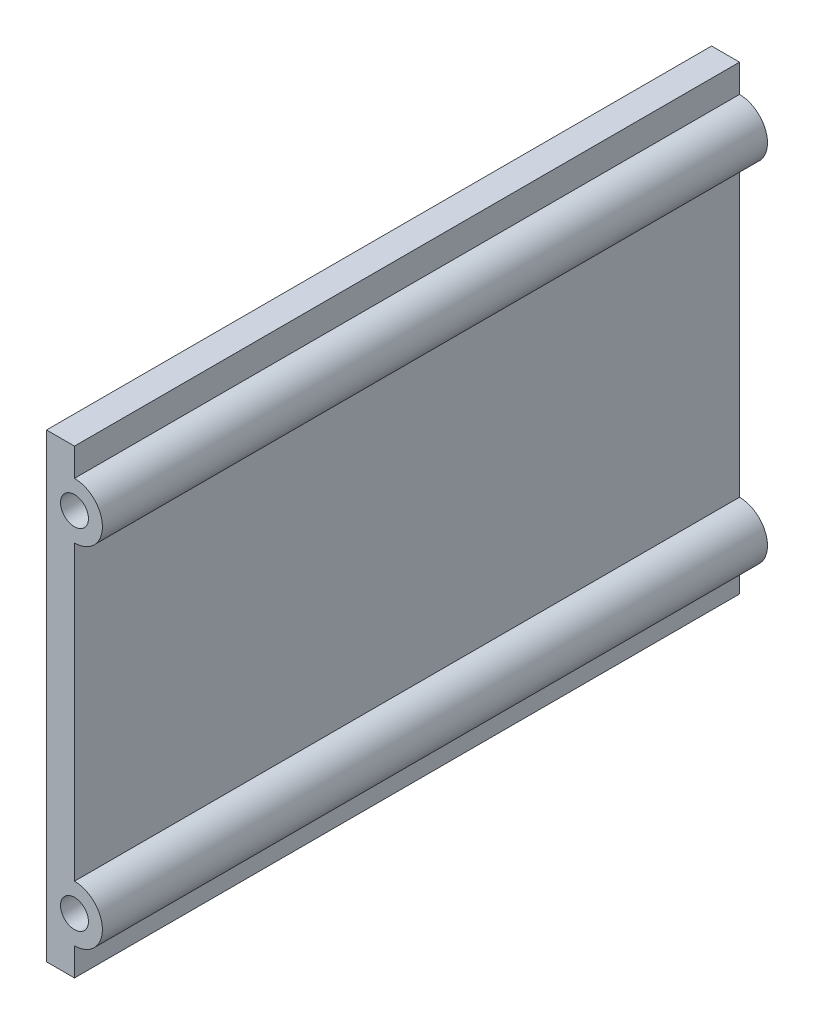
ISO-10303-21;
HEADER;
FILE_DESCRIPTION(('STEP AP214'),'2;1');
FILE_NAME('part.step','',(''),(''),'','','');
FILE_SCHEMA(('AUTOMOTIVE_DESIGN { 1 0 10303 214 1 1 1 1 }'));
ENDSEC;
DATA;
#1=APPLICATION_CONTEXT('core data for automotive mechanical design processes');
#2=APPLICATION_PROTOCOL_DEFINITION('international standard','automotive_design',2000,#1);
#3=PRODUCT_CONTEXT('',#1,'mechanical');
#4=PRODUCT('Part','Part','',(#3));
#5=PRODUCT_RELATED_PRODUCT_CATEGORY('part','',(#4));
#6=PRODUCT_DEFINITION_FORMATION('','',#4);
#7=PRODUCT_DEFINITION_CONTEXT('part definition',#1,'design');
#8=PRODUCT_DEFINITION('design','',#6,#7);
#9=PRODUCT_DEFINITION_SHAPE('','',#8);
#10=(LENGTH_UNIT() NAMED_UNIT(*) SI_UNIT(.MILLI.,.METRE.));
#11=(NAMED_UNIT(*) PLANE_ANGLE_UNIT() SI_UNIT($,.RADIAN.));
#12=(NAMED_UNIT(*) SI_UNIT($,.STERADIAN.) SOLID_ANGLE_UNIT());
#13=UNCERTAINTY_MEASURE_WITH_UNIT(LENGTH_MEASURE(1.E-05),#10,'distance_accuracy_value','');
#14=(GEOMETRIC_REPRESENTATION_CONTEXT(3) GLOBAL_UNCERTAINTY_ASSIGNED_CONTEXT((#13)) GLOBAL_UNIT_ASSIGNED_CONTEXT((#10,
#11,#12)) REPRESENTATION_CONTEXT('',''));
#15=CARTESIAN_POINT('',(0.,0.,0.));
#16=DIRECTION('',(0.,0.,1.));
#17=DIRECTION('',(1.,0.,0.));
#18=AXIS2_PLACEMENT_3D('',#15,#16,#17);
#19=CARTESIAN_POINT('',(-161.500000000327,31.210634294359,202.025691901636));
#20=DIRECTION('',(0.,0.,-1.));
#21=DIRECTION('',(-1.,0.,0.));
#22=AXIS2_PLACEMENT_3D('',#19,#20,#21);
#23=CYLINDRICAL_SURFACE('',#22,2.5);
#24=CARTESIAN_POINT('',(-161.500000000327,31.210634294359,0.));
#25=DIRECTION('',(0.,0.,1.));
#26=DIRECTION('',(1.,0.,0.));
#27=AXIS2_PLACEMENT_3D('',#24,#25,#26);
#28=CIRCLE('',#27,2.5);
#29=CARTESIAN_POINT('',(-159.000000000327,31.210634294359,0.));
#30=VERTEX_POINT('',#29);
#31=EDGE_CURVE('E140',#30,#30,#28,.T.);
#32=ORIENTED_EDGE('',*,*,#31,.F.);
#33=EDGE_LOOP('',(#32));
#34=FACE_BOUND('',#33,.T.);
#35=CARTESIAN_POINT('',(-161.500000000327,31.210634294359,118.999999999998));
#36=DIRECTION('',(0.,0.,1.));
#37=DIRECTION('',(0.,-1.,0.));
#38=AXIS2_PLACEMENT_3D('',#35,#36,#37);
#39=CIRCLE('',#38,2.5);
#40=CARTESIAN_POINT('',(-161.500000000327,28.710634294359,118.999999999998));
#41=VERTEX_POINT('',#40);
#42=EDGE_CURVE('E120',#41,#41,#39,.T.);
#43=ORIENTED_EDGE('',*,*,#42,.T.);
#44=EDGE_LOOP('',(#43));
#45=FACE_BOUND('',#44,.T.);
#46=ADVANCED_FACE('F35',(#34,#45),#23,.F.);
#47=CARTESIAN_POINT('',(-161.500000000317,26.2106342943589,202.025691901636));
#48=DIRECTION('',(-1.,0.,0.));
#49=DIRECTION('',(0.,0.,1.));
#50=AXIS2_PLACEMENT_3D('',#47,#48,#49);
#51=PLANE('',#50);
#52=DIRECTION('',(0.,1.,0.));
#53=VECTOR('',#52,1.);
#54=CARTESIAN_POINT('',(-161.500000000317,26.2106342943537,118.999999999998));
#55=LINE('',#54,#53);
#56=CARTESIAN_POINT('',(-161.500000000317,-26.2106342941675,119.));
#57=VERTEX_POINT('',#56);
#58=CARTESIAN_POINT('',(-161.500000000317,26.2106342943589,118.999999999998));
#59=VERTEX_POINT('',#58);
#60=EDGE_CURVE('E104',#57,#59,#55,.T.);
#61=ORIENTED_EDGE('',*,*,#60,.F.);
#62=DIRECTION('',(0.,0.,-1.));
#63=VECTOR('',#62,1.);
#64=CARTESIAN_POINT('',(-161.500000000317,-26.2106342941675,202.025691901636));
#65=LINE('',#64,#63);
#66=CARTESIAN_POINT('',(-161.500000000317,-26.2106342941675,0.));
#67=VERTEX_POINT('',#66);
#68=EDGE_CURVE('E51',#57,#67,#65,.T.);
#69=ORIENTED_EDGE('',*,*,#68,.T.);
#70=DIRECTION('',(0.,1.,0.));
#71=VECTOR('',#70,1.);
#72=CARTESIAN_POINT('',(-161.500000000317,26.2106342943589,0.));
#73=LINE('',#72,#71);
#74=CARTESIAN_POINT('',(-161.500000000317,26.2106342943589,0.));
#75=VERTEX_POINT('',#74);
#76=EDGE_CURVE('E107',#67,#75,#73,.T.);
#77=ORIENTED_EDGE('',*,*,#76,.T.);
#78=DIRECTION('',(0.,0.,-1.));
#79=VECTOR('',#78,1.);
#80=CARTESIAN_POINT('',(-161.500000000317,26.2106342943589,202.025691901636));
#81=LINE('',#80,#79);
#82=EDGE_CURVE('E100',#59,#75,#81,.T.);
#83=ORIENTED_EDGE('',*,*,#82,.F.);
#84=EDGE_LOOP('',(#61,#69,#77,#83));
#85=FACE_BOUND('',#84,.T.);
#86=ADVANCED_FACE('F102',(#85),#51,.F.);
#87=CARTESIAN_POINT('',(-161.500000000317,-31.2106342941764,202.025691901636));
#88=DIRECTION('',(0.,0.,-1.));
#89=DIRECTION('',(-1.,0.,0.));
#90=AXIS2_PLACEMENT_3D('',#87,#88,#89);
#91=CYLINDRICAL_SURFACE('',#90,5.00000000000894);
#92=CARTESIAN_POINT('',(-161.500000000317,-31.2106342941764,119.000000000002));
#93=DIRECTION('',(0.,0.,1.));
#94=DIRECTION('',(0.,-1.,0.));
#95=AXIS2_PLACEMENT_3D('',#92,#93,#94);
#96=CIRCLE('',#95,5.00000000000894);
#97=CARTESIAN_POINT('',(-161.500000000317,-36.2106342941854,119.000000000002));
#98=VERTEX_POINT('',#97);
#99=EDGE_CURVE('E119',#98,#57,#96,.T.);
#100=ORIENTED_EDGE('',*,*,#99,.F.);
#101=DIRECTION('',(0.,0.,-1.));
#102=VECTOR('',#101,1.);
#103=CARTESIAN_POINT('',(-161.500000000317,-36.2106342941854,202.025691901636));
#104=LINE('',#103,#102);
#105=CARTESIAN_POINT('',(-161.500000000317,-36.2106342941854,0.));
#106=VERTEX_POINT('',#105);
#107=EDGE_CURVE('E164',#98,#106,#104,.T.);
#108=ORIENTED_EDGE('',*,*,#107,.T.);
#109=CARTESIAN_POINT('',(-161.500000000317,-31.2106342941764,0.));
#110=DIRECTION('',(0.,0.,1.));
#111=DIRECTION('',(1.,0.,0.));
#112=AXIS2_PLACEMENT_3D('',#109,#110,#111);
#113=CIRCLE('',#112,5.00000000000894);
#114=EDGE_CURVE('E160',#106,#67,#113,.T.);
#115=ORIENTED_EDGE('',*,*,#114,.T.);
#116=ORIENTED_EDGE('',*,*,#68,.F.);
#117=EDGE_LOOP('',(#100,#108,#115,#116));
#118=FACE_BOUND('',#117,.T.);
#119=ADVANCED_FACE('F194',(#118),#91,.T.);
#120=CARTESIAN_POINT('',(-161.500000000317,-36.2106342941854,202.025691901636));
#121=DIRECTION('',(-1.,0.,0.));
#122=DIRECTION('',(0.,0.,1.));
#123=AXIS2_PLACEMENT_3D('',#120,#121,#122);
#124=PLANE('',#123);
#125=DIRECTION('',(0.,1.,0.));
#126=VECTOR('',#125,1.);
#127=CARTESIAN_POINT('',(-161.500000000317,-36.2106342941906,119.000000000002));
#128=LINE('',#127,#126);
#129=CARTESIAN_POINT('',(-161.500000000317,-41.2106342941854,119.000000000002));
#130=VERTEX_POINT('',#129);
#131=EDGE_CURVE('E122',#130,#98,#128,.T.);
#132=ORIENTED_EDGE('',*,*,#131,.F.);
#133=DIRECTION('',(0.,0.,-1.));
#134=VECTOR('',#133,1.);
#135=CARTESIAN_POINT('',(-161.500000000317,-41.2106342941854,202.025691901636));
#136=LINE('',#135,#134);
#137=CARTESIAN_POINT('',(-161.500000000317,-41.2106342941854,0.));
#138=VERTEX_POINT('',#137);
#139=EDGE_CURVE('E166',#130,#138,#136,.T.);
#140=ORIENTED_EDGE('',*,*,#139,.T.);
#141=DIRECTION('',(0.,1.,0.));
#142=VECTOR('',#141,1.);
#143=CARTESIAN_POINT('',(-161.500000000317,-36.2106342941854,0.));
#144=LINE('',#143,#142);
#145=EDGE_CURVE('E157',#138,#106,#144,.T.);
#146=ORIENTED_EDGE('',*,*,#145,.T.);
#147=ORIENTED_EDGE('',*,*,#107,.F.);
#148=EDGE_LOOP('',(#132,#140,#146,#147));
#149=FACE_BOUND('',#148,.T.);
#150=ADVANCED_FACE('F191',(#149),#124,.F.);
#151=CARTESIAN_POINT('',(-161.500000000317,-41.2106342941854,202.025691901636));
#152=DIRECTION('',(0.,1.,0.));
#153=DIRECTION('',(0.,0.,1.));
#154=AXIS2_PLACEMENT_3D('',#151,#152,#153);
#155=PLANE('',#154);
#156=DIRECTION('',(1.,0.,0.));
#157=VECTOR('',#156,1.);
#158=CARTESIAN_POINT('',(-161.500000000316,-41.2106342941854,119.000000000003));
#159=LINE('',#158,#157);
#160=CARTESIAN_POINT('',(-166.500000000327,-41.2106342941854,119.000000000003));
#161=VERTEX_POINT('',#160);
#162=EDGE_CURVE('E128',#161,#130,#159,.T.);
#163=ORIENTED_EDGE('',*,*,#162,.F.);
#164=DIRECTION('',(0.,0.,-1.));
#165=VECTOR('',#164,1.);
#166=CARTESIAN_POINT('',(-166.500000000327,-41.2106342941854,202.025691901636));
#167=LINE('',#166,#165);
#168=CARTESIAN_POINT('',(-166.500000000327,-41.2106342941854,0.));
#169=VERTEX_POINT('',#168);
#170=EDGE_CURVE('E168',#161,#169,#167,.T.);
#171=ORIENTED_EDGE('',*,*,#170,.T.);
#172=DIRECTION('',(1.,0.,0.));
#173=VECTOR('',#172,1.);
#174=CARTESIAN_POINT('',(-161.500000000317,-41.2106342941854,0.));
#175=LINE('',#174,#173);
#176=EDGE_CURVE('E154',#169,#138,#175,.T.);
#177=ORIENTED_EDGE('',*,*,#176,.T.);
#178=ORIENTED_EDGE('',*,*,#139,.F.);
#179=EDGE_LOOP('',(#163,#171,#177,#178));
#180=FACE_BOUND('',#179,.T.);
#181=ADVANCED_FACE('F189',(#180),#155,.F.);
#182=CARTESIAN_POINT('',(-166.500000000327,-41.2106342941854,202.025691901636));
#183=DIRECTION('',(1.,0.,0.));
#184=DIRECTION('',(0.,0.,-1.));
#185=AXIS2_PLACEMENT_3D('',#182,#183,#184);
#186=PLANE('',#185);
#187=DIRECTION('',(0.,-1.,0.));
#188=VECTOR('',#187,1.);
#189=CARTESIAN_POINT('',(-166.500000000327,-41.2106342941906,119.000000000003));
#190=LINE('',#189,#188);
#191=CARTESIAN_POINT('',(-166.500000000327,41.210634294359,119.));
#192=VERTEX_POINT('',#191);
#193=EDGE_CURVE('E131',#192,#161,#190,.T.);
#194=ORIENTED_EDGE('',*,*,#193,.F.);
#195=DIRECTION('',(0.,0.,-1.));
#196=VECTOR('',#195,1.);
#197=CARTESIAN_POINT('',(-166.500000000327,41.210634294359,202.025691901636));
#198=LINE('',#197,#196);
#199=CARTESIAN_POINT('',(-166.500000000327,41.210634294359,0.));
#200=VERTEX_POINT('',#199);
#201=EDGE_CURVE('E170',#192,#200,#198,.T.);
#202=ORIENTED_EDGE('',*,*,#201,.T.);
#203=DIRECTION('',(0.,-1.,0.));
#204=VECTOR('',#203,1.);
#205=CARTESIAN_POINT('',(-166.500000000327,-41.2106342941854,0.));
#206=LINE('',#205,#204);
#207=EDGE_CURVE('E151',#200,#169,#206,.T.);
#208=ORIENTED_EDGE('',*,*,#207,.T.);
#209=ORIENTED_EDGE('',*,*,#170,.F.);
#210=EDGE_LOOP('',(#194,#202,#208,#209));
#211=FACE_BOUND('',#210,.T.);
#212=ADVANCED_FACE('F186',(#211),#186,.F.);
#213=CARTESIAN_POINT('',(-161.500000000317,41.210634294359,202.025691901636));
#214=DIRECTION('',(0.,-1.,0.));
#215=DIRECTION('',(0.,0.,-1.));
#216=AXIS2_PLACEMENT_3D('',#213,#214,#215);
#217=PLANE('',#216);
#218=DIRECTION('',(-1.,0.,0.));
#219=VECTOR('',#218,1.);
#220=CARTESIAN_POINT('',(-161.500000000316,41.210634294359,118.999999999997));
#221=LINE('',#220,#219);
#222=CARTESIAN_POINT('',(-161.500000000317,41.210634294359,118.999999999997));
#223=VERTEX_POINT('',#222);
#224=EDGE_CURVE('E134',#223,#192,#221,.T.);
#225=ORIENTED_EDGE('',*,*,#224,.F.);
#226=DIRECTION('',(0.,0.,-1.));
#227=VECTOR('',#226,1.);
#228=CARTESIAN_POINT('',(-161.500000000317,41.210634294359,202.025691901636));
#229=LINE('',#228,#227);
#230=CARTESIAN_POINT('',(-161.500000000317,41.210634294359,0.));
#231=VERTEX_POINT('',#230);
#232=EDGE_CURVE('E44',#223,#231,#229,.T.);
#233=ORIENTED_EDGE('',*,*,#232,.T.);
#234=DIRECTION('',(-1.,0.,0.));
#235=VECTOR('',#234,1.);
#236=CARTESIAN_POINT('',(-161.500000000317,41.210634294359,0.));
#237=LINE('',#236,#235);
#238=EDGE_CURVE('E148',#231,#200,#237,.T.);
#239=ORIENTED_EDGE('',*,*,#238,.T.);
#240=ORIENTED_EDGE('',*,*,#201,.F.);
#241=EDGE_LOOP('',(#225,#233,#239,#240));
#242=FACE_BOUND('',#241,.T.);
#243=ADVANCED_FACE('F173',(#242),#217,.F.);
#244=CARTESIAN_POINT('',(-161.500000000317,36.210634294359,202.025691901636));
#245=DIRECTION('',(-1.,0.,0.));
#246=DIRECTION('',(0.,0.,1.));
#247=AXIS2_PLACEMENT_3D('',#244,#245,#246);
#248=PLANE('',#247);
#249=DIRECTION('',(0.,1.,0.));
#250=VECTOR('',#249,1.);
#251=CARTESIAN_POINT('',(-161.500000000317,36.2106342943538,118.999999999998));
#252=LINE('',#251,#250);
#253=CARTESIAN_POINT('',(-161.500000000317,36.210634294359,118.999999999998));
#254=VERTEX_POINT('',#253);
#255=EDGE_CURVE('E58',#254,#223,#252,.T.);
#256=ORIENTED_EDGE('',*,*,#255,.F.);
#257=DIRECTION('',(0.,0.,-1.));
#258=VECTOR('',#257,1.);
#259=CARTESIAN_POINT('',(-161.500000000317,36.210634294359,202.025691901636));
#260=LINE('',#259,#258);
#261=CARTESIAN_POINT('',(-161.500000000317,36.210634294359,0.));
#262=VERTEX_POINT('',#261);
#263=EDGE_CURVE('E11',#254,#262,#260,.T.);
#264=ORIENTED_EDGE('',*,*,#263,.T.);
#265=DIRECTION('',(0.,1.,0.));
#266=VECTOR('',#265,1.);
#267=CARTESIAN_POINT('',(-161.500000000317,36.210634294359,0.));
#268=LINE('',#267,#266);
#269=EDGE_CURVE('E145',#262,#231,#268,.T.);
#270=ORIENTED_EDGE('',*,*,#269,.T.);
#271=ORIENTED_EDGE('',*,*,#232,.F.);
#272=EDGE_LOOP('',(#256,#264,#270,#271));
#273=FACE_BOUND('',#272,.T.);
#274=ADVANCED_FACE('F177',(#273),#248,.F.);
#275=CARTESIAN_POINT('',(-161.500000000327,31.210634294359,202.025691901636));
#276=DIRECTION('',(0.,0.,-1.));
#277=DIRECTION('',(-1.,0.,0.));
#278=AXIS2_PLACEMENT_3D('',#275,#276,#277);
#279=CYLINDRICAL_SURFACE('',#278,5.00000000000003);
#280=CARTESIAN_POINT('',(-161.500000000327,31.210634294359,118.999999999998));
#281=DIRECTION('',(0.,0.,1.));
#282=DIRECTION('',(0.,-1.,0.));
#283=AXIS2_PLACEMENT_3D('',#280,#281,#282);
#284=CIRCLE('',#283,5.00000000000003);
#285=EDGE_CURVE('E113',#59,#254,#284,.T.);
#286=ORIENTED_EDGE('',*,*,#285,.F.);
#287=ORIENTED_EDGE('',*,*,#82,.T.);
#288=CARTESIAN_POINT('',(-161.500000000327,31.210634294359,0.));
#289=DIRECTION('',(0.,0.,1.));
#290=DIRECTION('',(1.,0.,0.));
#291=AXIS2_PLACEMENT_3D('',#288,#289,#290);
#292=CIRCLE('',#291,5.00000000000003);
#293=EDGE_CURVE('E143',#75,#262,#292,.T.);
#294=ORIENTED_EDGE('',*,*,#293,.T.);
#295=ORIENTED_EDGE('',*,*,#263,.F.);
#296=EDGE_LOOP('',(#286,#287,#294,#295));
#297=FACE_BOUND('',#296,.T.);
#298=ADVANCED_FACE('F37',(#297),#279,.T.);
#299=CARTESIAN_POINT('',(-161.500000000327,31.210634294359,0.));
#300=DIRECTION('',(0.,0.,1.));
#301=DIRECTION('',(1.,0.,0.));
#302=AXIS2_PLACEMENT_3D('',#299,#300,#301);
#303=PLANE('',#302);
#304=ORIENTED_EDGE('',*,*,#293,.F.);
#305=ORIENTED_EDGE('',*,*,#76,.F.);
#306=ORIENTED_EDGE('',*,*,#114,.F.);
#307=ORIENTED_EDGE('',*,*,#145,.F.);
#308=ORIENTED_EDGE('',*,*,#176,.F.);
#309=ORIENTED_EDGE('',*,*,#207,.F.);
#310=ORIENTED_EDGE('',*,*,#238,.F.);
#311=ORIENTED_EDGE('',*,*,#269,.F.);
#312=EDGE_LOOP('',(#304,#305,#306,#307,#308,#309,#310,#311));
#313=FACE_BOUND('',#312,.T.);
#314=ORIENTED_EDGE('',*,*,#31,.T.);
#315=EDGE_LOOP('',(#314));
#316=FACE_BOUND('',#315,.T.);
#317=CARTESIAN_POINT('',(-161.500000000317,-31.2106342941764,0.));
#318=DIRECTION('',(0.,0.,1.));
#319=DIRECTION('',(1.,0.,0.));
#320=AXIS2_PLACEMENT_3D('',#317,#318,#319);
#321=CIRCLE('',#320,2.5);
#322=CARTESIAN_POINT('',(-159.000000000317,-31.2106342941764,0.));
#323=VERTEX_POINT('',#322);
#324=EDGE_CURVE('E115',#323,#323,#321,.T.);
#325=ORIENTED_EDGE('',*,*,#324,.T.);
#326=EDGE_LOOP('',(#325));
#327=FACE_BOUND('',#326,.T.);
#328=ADVANCED_FACE('F180',(#313,#316,#327),#303,.F.);
#329=CARTESIAN_POINT('',(-161.500000000317,-31.2106342941764,202.025691901636));
#330=DIRECTION('',(0.,0.,-1.));
#331=DIRECTION('',(-1.,0.,0.));
#332=AXIS2_PLACEMENT_3D('',#329,#330,#331);
#333=CYLINDRICAL_SURFACE('',#332,2.5);
#334=ORIENTED_EDGE('',*,*,#324,.F.);
#335=EDGE_LOOP('',(#334));
#336=FACE_BOUND('',#335,.T.);
#337=CARTESIAN_POINT('',(-161.500000000317,-31.2106342941764,119.000000000002));
#338=DIRECTION('',(0.,0.,1.));
#339=DIRECTION('',(0.,-1.,0.));
#340=AXIS2_PLACEMENT_3D('',#337,#338,#339);
#341=CIRCLE('',#340,2.5);
#342=CARTESIAN_POINT('',(-161.500000000317,-33.7106342941764,119.000000000002));
#343=VERTEX_POINT('',#342);
#344=EDGE_CURVE('E39',#343,#343,#341,.T.);
#345=ORIENTED_EDGE('',*,*,#344,.T.);
#346=EDGE_LOOP('',(#345));
#347=FACE_BOUND('',#346,.T.);
#348=ADVANCED_FACE('F212',(#336,#347),#333,.F.);
#349=CARTESIAN_POINT('',(-9.50384215769873E-12,2.07090686333974E-10,119.000000000003));
#350=DIRECTION('',(0.,0.,1.));
#351=DIRECTION('',(-1.,1.28311973053189E-13,0.));
#352=AXIS2_PLACEMENT_3D('',#349,#350,#351);
#353=PLANE('',#352);
#354=ORIENTED_EDGE('',*,*,#344,.F.);
#355=EDGE_LOOP('',(#354));
#356=FACE_BOUND('',#355,.T.);
#357=ORIENTED_EDGE('',*,*,#42,.F.);
#358=EDGE_LOOP('',(#357));
#359=FACE_BOUND('',#358,.T.);
#360=ORIENTED_EDGE('',*,*,#60,.T.);
#361=ORIENTED_EDGE('',*,*,#285,.T.);
#362=ORIENTED_EDGE('',*,*,#255,.T.);
#363=ORIENTED_EDGE('',*,*,#224,.T.);
#364=ORIENTED_EDGE('',*,*,#193,.T.);
#365=ORIENTED_EDGE('',*,*,#162,.T.);
#366=ORIENTED_EDGE('',*,*,#131,.T.);
#367=ORIENTED_EDGE('',*,*,#99,.T.);
#368=EDGE_LOOP('',(#360,#361,#362,#363,#364,#365,#366,#367));
#369=FACE_BOUND('',#368,.T.);
#370=ADVANCED_FACE('F117',(#356,#359,#369),#353,.T.);
#371=CLOSED_SHELL('',(#46,#86,#119,#150,#181,#212,#243,#274,#298,#328,#348,#370));
#372=MANIFOLD_SOLID_BREP('B2',#371);
#373=ADVANCED_BREP_SHAPE_REPRESENTATION('',(#18,#372),#14);
#374=SHAPE_DEFINITION_REPRESENTATION(#9,#373);
ENDSEC;
END-ISO-10303-21;
